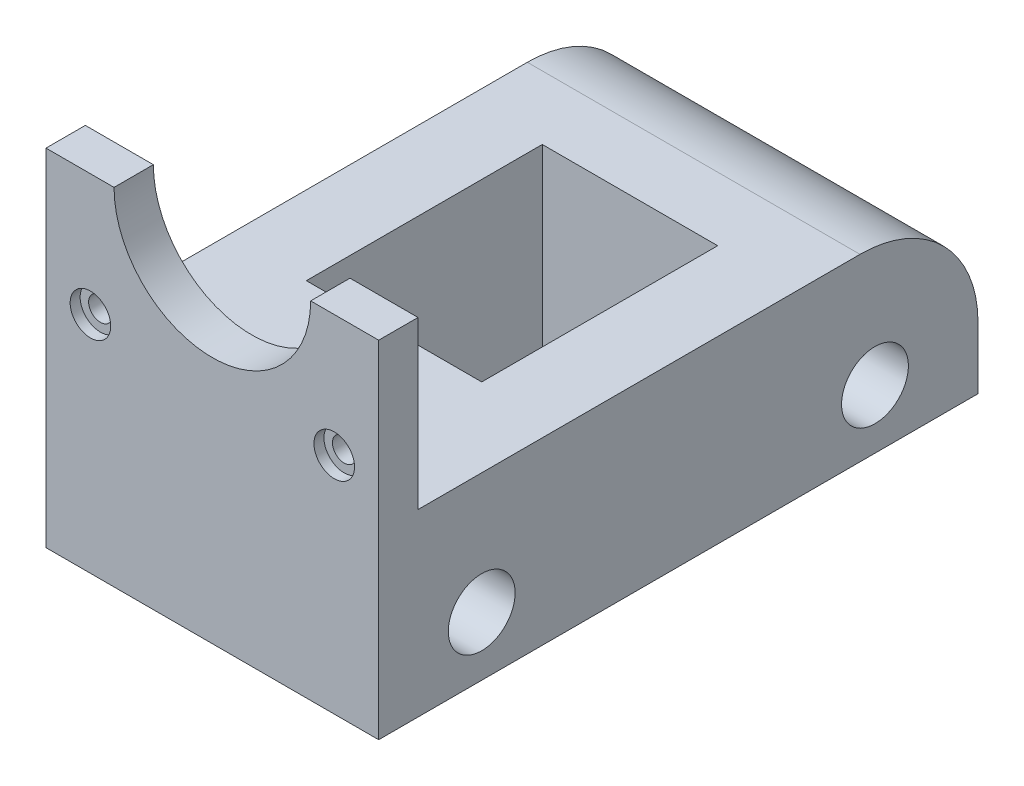
ISO-10303-21;
HEADER;
FILE_DESCRIPTION(('STEP AP214'),'2;1');
FILE_NAME('part.step','',(''),(''),'','','');
FILE_SCHEMA(('AUTOMOTIVE_DESIGN { 1 0 10303 214 1 1 1 1 }'));
ENDSEC;
DATA;
#1=APPLICATION_CONTEXT('core data for automotive mechanical design processes');
#2=APPLICATION_PROTOCOL_DEFINITION('international standard','automotive_design',2000,#1);
#3=PRODUCT_CONTEXT('',#1,'mechanical');
#4=PRODUCT('Part','Part','',(#3));
#5=PRODUCT_RELATED_PRODUCT_CATEGORY('part','',(#4));
#6=PRODUCT_DEFINITION_FORMATION('','',#4);
#7=PRODUCT_DEFINITION_CONTEXT('part definition',#1,'design');
#8=PRODUCT_DEFINITION('design','',#6,#7);
#9=PRODUCT_DEFINITION_SHAPE('','',#8);
#10=(LENGTH_UNIT() NAMED_UNIT(*) SI_UNIT(.MILLI.,.METRE.));
#11=(NAMED_UNIT(*) PLANE_ANGLE_UNIT() SI_UNIT($,.RADIAN.));
#12=(NAMED_UNIT(*) SI_UNIT($,.STERADIAN.) SOLID_ANGLE_UNIT());
#13=UNCERTAINTY_MEASURE_WITH_UNIT(LENGTH_MEASURE(1.E-05),#10,'distance_accuracy_value','');
#14=(GEOMETRIC_REPRESENTATION_CONTEXT(3) GLOBAL_UNCERTAINTY_ASSIGNED_CONTEXT((#13)) GLOBAL_UNIT_ASSIGNED_CONTEXT((#10,
#11,#12)) REPRESENTATION_CONTEXT('',''));
#15=CARTESIAN_POINT('',(0.,0.,0.));
#16=DIRECTION('',(0.,0.,1.));
#17=DIRECTION('',(1.,0.,0.));
#18=AXIS2_PLACEMENT_3D('',#15,#16,#17);
#19=CARTESIAN_POINT('',(-13.5314935064935,20.65,-10.162987012987));
#20=DIRECTION('',(0.,0.,1.));
#21=DIRECTION('',(1.,0.,0.));
#22=AXIS2_PLACEMENT_3D('',#19,#20,#21);
#23=CYLINDRICAL_SURFACE('',#22,1.5);
#24=CARTESIAN_POINT('',(-13.5314935064935,20.65,61.037012987013));
#25=DIRECTION('',(0.,0.,-1.));
#26=DIRECTION('',(-1.,0.,0.));
#27=AXIS2_PLACEMENT_3D('',#24,#25,#26);
#28=CIRCLE('',#27,1.5);
#29=CARTESIAN_POINT('',(-15.0314935064935,20.65,61.037012987013));
#30=VERTEX_POINT('',#29);
#31=EDGE_CURVE('E264',#30,#30,#28,.T.);
#32=ORIENTED_EDGE('',*,*,#31,.T.);
#33=EDGE_LOOP('',(#32));
#34=FACE_BOUND('',#33,.T.);
#35=CARTESIAN_POINT('',(-13.5314935064935,20.65,64.767012987013));
#36=DIRECTION('',(0.,0.,1.));
#37=DIRECTION('',(1.,0.,0.));
#38=AXIS2_PLACEMENT_3D('',#35,#36,#37);
#39=CIRCLE('',#38,1.5);
#40=CARTESIAN_POINT('',(-12.0314935064935,20.65,64.767012987013));
#41=VERTEX_POINT('',#40);
#42=EDGE_CURVE('E230',#41,#41,#39,.F.);
#43=ORIENTED_EDGE('',*,*,#42,.F.);
#44=EDGE_LOOP('',(#43));
#45=FACE_BOUND('',#44,.T.);
#46=ADVANCED_FACE('F60',(#34,#45),#23,.F.);
#47=CARTESIAN_POINT('',(-19.1814935064935,15.,66.037012987013));
#48=DIRECTION('',(0.,0.,-1.));
#49=DIRECTION('',(-1.,0.,0.));
#50=AXIS2_PLACEMENT_3D('',#47,#48,#49);
#51=PLANE('',#50);
#52=CARTESIAN_POINT('',(-13.5314935064935,20.65,66.037012987013));
#53=DIRECTION('',(0.,0.,1.));
#54=DIRECTION('',(1.,0.,0.));
#55=AXIS2_PLACEMENT_3D('',#52,#53,#54);
#56=CIRCLE('',#55,2.58);
#57=CARTESIAN_POINT('',(-10.9514935064935,20.65,66.037012987013));
#58=VERTEX_POINT('',#57);
#59=EDGE_CURVE('E231',#58,#58,#56,.T.);
#60=ORIENTED_EDGE('',*,*,#59,.F.);
#61=EDGE_LOOP('',(#60));
#62=FACE_BOUND('',#61,.T.);
#63=CARTESIAN_POINT('',(17.4685064935065,20.65,66.037012987013));
#64=DIRECTION('',(0.,0.,1.));
#65=DIRECTION('',(-1.,0.,0.));
#66=AXIS2_PLACEMENT_3D('',#63,#64,#65);
#67=CIRCLE('',#66,2.58);
#68=CARTESIAN_POINT('',(14.8885064935065,20.65,66.037012987013));
#69=VERTEX_POINT('',#68);
#70=EDGE_CURVE('E225',#69,#69,#67,.T.);
#71=ORIENTED_EDGE('',*,*,#70,.F.);
#72=EDGE_LOOP('',(#71));
#73=FACE_BOUND('',#72,.T.);
#74=CARTESIAN_POINT('',(1.9685064935065,36.15,66.037012987013));
#75=DIRECTION('',(0.,0.,1.));
#76=DIRECTION('',(1.,0.,0.));
#77=AXIS2_PLACEMENT_3D('',#74,#75,#76);
#78=CIRCLE('',#77,12.5);
#79=CARTESIAN_POINT('',(-10.5314935064935,36.15,66.037012987013));
#80=VERTEX_POINT('',#79);
#81=CARTESIAN_POINT('',(14.4685064935065,36.15,66.037012987013));
#82=VERTEX_POINT('',#81);
#83=EDGE_CURVE('E246',#80,#82,#78,.T.);
#84=ORIENTED_EDGE('',*,*,#83,.F.);
#85=DIRECTION('',(1.,0.,0.));
#86=VECTOR('',#85,1.);
#87=CARTESIAN_POINT('',(0.,36.15,66.037012987013));
#88=LINE('',#87,#86);
#89=CARTESIAN_POINT('',(-19.1814935064935,36.15,66.037012987013));
#90=VERTEX_POINT('',#89);
#91=EDGE_CURVE('E245',#90,#80,#88,.T.);
#92=ORIENTED_EDGE('',*,*,#91,.F.);
#93=DIRECTION('',(0.,-1.,0.));
#94=VECTOR('',#93,1.);
#95=CARTESIAN_POINT('',(-19.1814935064935,15.,66.037012987013));
#96=LINE('',#95,#94);
#97=CARTESIAN_POINT('',(-19.1814935064935,-7.85,66.037012987013));
#98=VERTEX_POINT('',#97);
#99=EDGE_CURVE('E292',#90,#98,#96,.T.);
#100=ORIENTED_EDGE('',*,*,#99,.T.);
#101=DIRECTION('',(-1.,0.,0.));
#102=VECTOR('',#101,1.);
#103=CARTESIAN_POINT('',(23.1185064935065,-7.85,66.037012987013));
#104=LINE('',#103,#102);
#105=CARTESIAN_POINT('',(23.1185064935065,-7.85,66.037012987013));
#106=VERTEX_POINT('',#105);
#107=EDGE_CURVE('E191',#106,#98,#104,.T.);
#108=ORIENTED_EDGE('',*,*,#107,.F.);
#109=DIRECTION('',(0.,-1.,0.));
#110=VECTOR('',#109,1.);
#111=CARTESIAN_POINT('',(23.1185064935065,15.,66.037012987013));
#112=LINE('',#111,#110);
#113=CARTESIAN_POINT('',(23.1185064935065,36.15,66.037012987013));
#114=VERTEX_POINT('',#113);
#115=EDGE_CURVE('E289',#114,#106,#112,.T.);
#116=ORIENTED_EDGE('',*,*,#115,.F.);
#117=EDGE_CURVE('E242',#82,#114,#88,.T.);
#118=ORIENTED_EDGE('',*,*,#117,.F.);
#119=EDGE_LOOP('',(#84,#92,#100,#108,#116,#118));
#120=FACE_BOUND('',#119,.T.);
#121=ADVANCED_FACE('F337',(#62,#73,#120),#51,.F.);
#122=CARTESIAN_POINT('',(0.,0.,61.037012987013));
#123=DIRECTION('',(0.,0.,-1.));
#124=DIRECTION('',(-1.,0.,0.));
#125=AXIS2_PLACEMENT_3D('',#122,#123,#124);
#126=PLANE('',#125);
#127=CARTESIAN_POINT('',(17.4685064935065,20.65,61.037012987013));
#128=DIRECTION('',(0.,0.,-1.));
#129=DIRECTION('',(-1.,0.,0.));
#130=AXIS2_PLACEMENT_3D('',#127,#128,#129);
#131=CIRCLE('',#130,1.5);
#132=CARTESIAN_POINT('',(15.9685064935065,20.65,61.037012987013));
#133=VERTEX_POINT('',#132);
#134=EDGE_CURVE('E306',#133,#133,#131,.F.);
#135=ORIENTED_EDGE('',*,*,#134,.T.);
#136=EDGE_LOOP('',(#135));
#137=FACE_BOUND('',#136,.T.);
#138=DIRECTION('',(-1.,0.,0.));
#139=VECTOR('',#138,1.);
#140=CARTESIAN_POINT('',(0.,36.15,61.037012987013));
#141=LINE('',#140,#139);
#142=CARTESIAN_POINT('',(-10.5314935064935,36.15,61.037012987013));
#143=VERTEX_POINT('',#142);
#144=CARTESIAN_POINT('',(-19.1814935064935,36.15,61.037012987013));
#145=VERTEX_POINT('',#144);
#146=EDGE_CURVE('E302',#143,#145,#141,.T.);
#147=ORIENTED_EDGE('',*,*,#146,.F.);
#148=CARTESIAN_POINT('',(1.9685064935065,36.15,61.037012987013));
#149=DIRECTION('',(0.,0.,-1.));
#150=DIRECTION('',(-1.,0.,0.));
#151=AXIS2_PLACEMENT_3D('',#148,#149,#150);
#152=CIRCLE('',#151,12.5);
#153=CARTESIAN_POINT('',(14.4685064935065,36.15,61.037012987013));
#154=VERTEX_POINT('',#153);
#155=EDGE_CURVE('E295',#154,#143,#152,.T.);
#156=ORIENTED_EDGE('',*,*,#155,.F.);
#157=DIRECTION('',(-1.,0.,0.));
#158=VECTOR('',#157,1.);
#159=CARTESIAN_POINT('',(0.,36.15,61.037012987013));
#160=LINE('',#159,#158);
#161=CARTESIAN_POINT('',(23.1185064935065,36.15,61.037012987013));
#162=VERTEX_POINT('',#161);
#163=EDGE_CURVE('E298',#162,#154,#160,.T.);
#164=ORIENTED_EDGE('',*,*,#163,.F.);
#165=DIRECTION('',(0.,1.,0.));
#166=VECTOR('',#165,1.);
#167=CARTESIAN_POINT('',(23.1185064935065,15.,61.037012987013));
#168=LINE('',#167,#166);
#169=CARTESIAN_POINT('',(23.1185064935065,15.,61.037012987013));
#170=VERTEX_POINT('',#169);
#171=EDGE_CURVE('E272',#170,#162,#168,.T.);
#172=ORIENTED_EDGE('',*,*,#171,.F.);
#173=DIRECTION('',(1.,0.,0.));
#174=VECTOR('',#173,1.);
#175=CARTESIAN_POINT('',(-19.1814935064935,15.,61.037012987013));
#176=LINE('',#175,#174);
#177=CARTESIAN_POINT('',(-19.1814935064935,15.,61.037012987013));
#178=VERTEX_POINT('',#177);
#179=EDGE_CURVE('E268',#178,#170,#176,.T.);
#180=ORIENTED_EDGE('',*,*,#179,.F.);
#181=DIRECTION('',(0.,-1.,0.));
#182=VECTOR('',#181,1.);
#183=CARTESIAN_POINT('',(-19.1814935064935,15.,61.037012987013));
#184=LINE('',#183,#182);
#185=EDGE_CURVE('E250',#145,#178,#184,.T.);
#186=ORIENTED_EDGE('',*,*,#185,.F.);
#187=EDGE_LOOP('',(#147,#156,#164,#172,#180,#186));
#188=FACE_BOUND('',#187,.T.);
#189=ORIENTED_EDGE('',*,*,#31,.F.);
#190=EDGE_LOOP('',(#189));
#191=FACE_BOUND('',#190,.T.);
#192=ADVANCED_FACE('F344',(#137,#188,#191),#126,.T.);
#193=CARTESIAN_POINT('',(0.,15.,0.));
#194=DIRECTION('',(0.,1.,0.));
#195=DIRECTION('',(0.,0.,1.));
#196=AXIS2_PLACEMENT_3D('',#193,#194,#195);
#197=PLANE('',#196);
#198=DIRECTION('',(0.,0.,-1.));
#199=VECTOR('',#198,1.);
#200=CARTESIAN_POINT('',(13.1185064935065,15.,0.));
#201=LINE('',#200,#199);
#202=CARTESIAN_POINT('',(13.1185064935065,15.,42.937012987013));
#203=VERTEX_POINT('',#202);
#204=CARTESIAN_POINT('',(13.1185064935065,15.,12.937012987013));
#205=VERTEX_POINT('',#204);
#206=EDGE_CURVE('E222',#203,#205,#201,.T.);
#207=ORIENTED_EDGE('',*,*,#206,.F.);
#208=DIRECTION('',(1.,0.,0.));
#209=VECTOR('',#208,1.);
#210=CARTESIAN_POINT('',(0.,15.,42.937012987013));
#211=LINE('',#210,#209);
#212=CARTESIAN_POINT('',(-9.18149350649351,15.,42.937012987013));
#213=VERTEX_POINT('',#212);
#214=EDGE_CURVE('E161',#213,#203,#211,.T.);
#215=ORIENTED_EDGE('',*,*,#214,.F.);
#216=DIRECTION('',(0.,0.,1.));
#217=VECTOR('',#216,1.);
#218=CARTESIAN_POINT('',(-9.18149350649351,15.,0.));
#219=LINE('',#218,#217);
#220=CARTESIAN_POINT('',(-9.18149350649351,15.,12.937012987013));
#221=VERTEX_POINT('',#220);
#222=EDGE_CURVE('E215',#221,#213,#219,.T.);
#223=ORIENTED_EDGE('',*,*,#222,.F.);
#224=DIRECTION('',(-1.,0.,0.));
#225=VECTOR('',#224,1.);
#226=CARTESIAN_POINT('',(0.,15.,12.937012987013));
#227=LINE('',#226,#225);
#228=EDGE_CURVE('E219',#205,#221,#227,.T.);
#229=ORIENTED_EDGE('',*,*,#228,.F.);
#230=EDGE_LOOP('',(#207,#215,#223,#229));
#231=FACE_BOUND('',#230,.T.);
#232=DIRECTION('',(0.,0.,-1.));
#233=VECTOR('',#232,1.);
#234=CARTESIAN_POINT('',(23.1185064935065,15.,-10.162987012987));
#235=LINE('',#234,#233);
#236=CARTESIAN_POINT('',(23.1185064935065,15.,4.83701298701298));
#237=VERTEX_POINT('',#236);
#238=EDGE_CURVE('E279',#170,#237,#235,.T.);
#239=ORIENTED_EDGE('',*,*,#238,.T.);
#240=DIRECTION('',(-1.,0.,0.));
#241=VECTOR('',#240,1.);
#242=CARTESIAN_POINT('',(-19.1814935064935,15.,4.83701298701298));
#243=LINE('',#242,#241);
#244=CARTESIAN_POINT('',(-19.1814935064935,15.,4.83701298701298));
#245=VERTEX_POINT('',#244);
#246=EDGE_CURVE('E305',#237,#245,#243,.T.);
#247=ORIENTED_EDGE('',*,*,#246,.T.);
#248=DIRECTION('',(0.,0.,1.));
#249=VECTOR('',#248,1.);
#250=CARTESIAN_POINT('',(-19.1814935064935,15.,-10.162987012987));
#251=LINE('',#250,#249);
#252=EDGE_CURVE('E276',#245,#178,#251,.T.);
#253=ORIENTED_EDGE('',*,*,#252,.T.);
#254=ORIENTED_EDGE('',*,*,#179,.T.);
#255=EDGE_LOOP('',(#239,#247,#253,#254));
#256=FACE_BOUND('',#255,.T.);
#257=ADVANCED_FACE('F451',(#231,#256),#197,.T.);
#258=CARTESIAN_POINT('',(-19.1814935064935,15.,-10.162987012987));
#259=DIRECTION('',(1.,0.,0.));
#260=DIRECTION('',(0.,0.,-1.));
#261=AXIS2_PLACEMENT_3D('',#258,#259,#260);
#262=PLANE('',#261);
#263=CARTESIAN_POINT('',(-19.1814935064935,-0.349999999999996,52.937012987013));
#264=DIRECTION('',(1.,0.,0.));
#265=DIRECTION('',(0.,0.,-1.));
#266=AXIS2_PLACEMENT_3D('',#263,#264,#265);
#267=CIRCLE('',#266,4.25000000000001);
#268=CARTESIAN_POINT('',(-19.1814935064935,-0.349999999999996,48.687012987013));
#269=VERTEX_POINT('',#268);
#270=EDGE_CURVE('E177',#269,#269,#267,.T.);
#271=ORIENTED_EDGE('',*,*,#270,.T.);
#272=EDGE_LOOP('',(#271));
#273=FACE_BOUND('',#272,.T.);
#274=CARTESIAN_POINT('',(-19.1814935064935,-0.349999999999996,2.93701298701299));
#275=DIRECTION('',(1.,0.,0.));
#276=DIRECTION('',(0.,0.,1.));
#277=AXIS2_PLACEMENT_3D('',#274,#275,#276);
#278=CIRCLE('',#277,4.25000000000001);
#279=CARTESIAN_POINT('',(-19.1814935064935,-0.349999999999996,7.187012987013));
#280=VERTEX_POINT('',#279);
#281=EDGE_CURVE('E431',#280,#280,#278,.T.);
#282=ORIENTED_EDGE('',*,*,#281,.T.);
#283=EDGE_LOOP('',(#282));
#284=FACE_BOUND('',#283,.T.);
#285=ORIENTED_EDGE('',*,*,#252,.F.);
#286=CARTESIAN_POINT('',(-19.1814935064935,0.,4.83701298701298));
#287=DIRECTION('',(1.,0.,0.));
#288=DIRECTION('',(0.,0.,-1.));
#289=AXIS2_PLACEMENT_3D('',#286,#287,#288);
#290=CIRCLE('',#289,15.);
#291=CARTESIAN_POINT('',(-19.1814935064935,0.,-10.162987012987));
#292=VERTEX_POINT('',#291);
#293=EDGE_CURVE('E83',#245,#292,#290,.F.);
#294=ORIENTED_EDGE('',*,*,#293,.T.);
#295=DIRECTION('',(0.,-1.,0.));
#296=VECTOR('',#295,1.);
#297=CARTESIAN_POINT('',(-19.1814935064935,15.,-10.162987012987));
#298=LINE('',#297,#296);
#299=CARTESIAN_POINT('',(-19.1814935064935,-7.85,-10.162987012987));
#300=VERTEX_POINT('',#299);
#301=EDGE_CURVE('E283',#292,#300,#298,.T.);
#302=ORIENTED_EDGE('',*,*,#301,.T.);
#303=DIRECTION('',(0.,0.,-1.));
#304=VECTOR('',#303,1.);
#305=CARTESIAN_POINT('',(-19.1814935064935,-7.85,66.037012987013));
#306=LINE('',#305,#304);
#307=EDGE_CURVE('E195',#98,#300,#306,.T.);
#308=ORIENTED_EDGE('',*,*,#307,.F.);
#309=ORIENTED_EDGE('',*,*,#99,.F.);
#310=DIRECTION('',(0.,0.,1.));
#311=VECTOR('',#310,1.);
#312=CARTESIAN_POINT('',(-19.1814935064935,36.15,-10.162987012987));
#313=LINE('',#312,#311);
#314=EDGE_CURVE('E251',#145,#90,#313,.T.);
#315=ORIENTED_EDGE('',*,*,#314,.F.);
#316=ORIENTED_EDGE('',*,*,#185,.T.);
#317=EDGE_LOOP('',(#285,#294,#302,#308,#309,#315,#316));
#318=FACE_BOUND('',#317,.T.);
#319=ADVANCED_FACE('F348',(#273,#284,#318),#262,.F.);
#320=CARTESIAN_POINT('',(23.1185064935065,15.,-10.162987012987));
#321=DIRECTION('',(-1.,0.,0.));
#322=DIRECTION('',(0.,0.,1.));
#323=AXIS2_PLACEMENT_3D('',#320,#321,#322);
#324=PLANE('',#323);
#325=CARTESIAN_POINT('',(23.1185064935065,-0.349999999999996,52.937012987013));
#326=DIRECTION('',(1.,0.,0.));
#327=DIRECTION('',(0.,0.,-1.));
#328=AXIS2_PLACEMENT_3D('',#325,#326,#327);
#329=CIRCLE('',#328,4.25000000000001);
#330=CARTESIAN_POINT('',(23.1185064935065,-0.349999999999996,48.687012987013));
#331=VERTEX_POINT('',#330);
#332=EDGE_CURVE('E428',#331,#331,#329,.T.);
#333=ORIENTED_EDGE('',*,*,#332,.F.);
#334=EDGE_LOOP('',(#333));
#335=FACE_BOUND('',#334,.T.);
#336=CARTESIAN_POINT('',(23.1185064935065,-0.349999999999996,2.93701298701299));
#337=DIRECTION('',(1.,0.,0.));
#338=DIRECTION('',(0.,0.,1.));
#339=AXIS2_PLACEMENT_3D('',#336,#337,#338);
#340=CIRCLE('',#339,4.25000000000001);
#341=CARTESIAN_POINT('',(23.1185064935065,-0.349999999999996,7.18701298701299));
#342=VERTEX_POINT('',#341);
#343=EDGE_CURVE('E437',#342,#342,#340,.T.);
#344=ORIENTED_EDGE('',*,*,#343,.F.);
#345=EDGE_LOOP('',(#344));
#346=FACE_BOUND('',#345,.T.);
#347=DIRECTION('',(0.,-1.,0.));
#348=VECTOR('',#347,1.);
#349=CARTESIAN_POINT('',(23.1185064935065,15.,-10.162987012987));
#350=LINE('',#349,#348);
#351=CARTESIAN_POINT('',(23.1185064935065,0.,-10.162987012987));
#352=VERTEX_POINT('',#351);
#353=CARTESIAN_POINT('',(23.1185064935065,-7.85,-10.162987012987));
#354=VERTEX_POINT('',#353);
#355=EDGE_CURVE('E286',#352,#354,#350,.T.);
#356=ORIENTED_EDGE('',*,*,#355,.F.);
#357=CARTESIAN_POINT('',(23.1185064935065,0.,4.83701298701298));
#358=DIRECTION('',(-1.,0.,0.));
#359=DIRECTION('',(0.,0.,1.));
#360=AXIS2_PLACEMENT_3D('',#357,#358,#359);
#361=CIRCLE('',#360,15.);
#362=EDGE_CURVE('E12',#352,#237,#361,.F.);
#363=ORIENTED_EDGE('',*,*,#362,.T.);
#364=ORIENTED_EDGE('',*,*,#238,.F.);
#365=ORIENTED_EDGE('',*,*,#171,.T.);
#366=DIRECTION('',(0.,0.,1.));
#367=VECTOR('',#366,1.);
#368=CARTESIAN_POINT('',(23.1185064935065,36.15,-10.162987012987));
#369=LINE('',#368,#367);
#370=EDGE_CURVE('E254',#162,#114,#369,.T.);
#371=ORIENTED_EDGE('',*,*,#370,.T.);
#372=ORIENTED_EDGE('',*,*,#115,.T.);
#373=DIRECTION('',(0.,0.,1.));
#374=VECTOR('',#373,1.);
#375=CARTESIAN_POINT('',(23.1185064935065,-7.85,-10.162987012987));
#376=LINE('',#375,#374);
#377=EDGE_CURVE('E166',#354,#106,#376,.T.);
#378=ORIENTED_EDGE('',*,*,#377,.F.);
#379=EDGE_LOOP('',(#356,#363,#364,#365,#371,#372,#378));
#380=FACE_BOUND('',#379,.T.);
#381=ADVANCED_FACE('F355',(#335,#346,#380),#324,.F.);
#382=CARTESIAN_POINT('',(-19.1814935064935,15.,-10.162987012987));
#383=DIRECTION('',(0.,0.,1.));
#384=DIRECTION('',(1.,0.,0.));
#385=AXIS2_PLACEMENT_3D('',#382,#383,#384);
#386=PLANE('',#385);
#387=ORIENTED_EDGE('',*,*,#301,.F.);
#388=DIRECTION('',(-1.,0.,0.));
#389=VECTOR('',#388,1.);
#390=CARTESIAN_POINT('',(23.1185064935065,0.,-10.162987012987));
#391=LINE('',#390,#389);
#392=EDGE_CURVE('E69',#292,#352,#391,.F.);
#393=ORIENTED_EDGE('',*,*,#392,.T.);
#394=ORIENTED_EDGE('',*,*,#355,.T.);
#395=DIRECTION('',(1.,0.,0.));
#396=VECTOR('',#395,1.);
#397=CARTESIAN_POINT('',(-19.1814935064935,-7.85,-10.162987012987));
#398=LINE('',#397,#396);
#399=EDGE_CURVE('E199',#300,#354,#398,.T.);
#400=ORIENTED_EDGE('',*,*,#399,.F.);
#401=EDGE_LOOP('',(#387,#393,#394,#400));
#402=FACE_BOUND('',#401,.T.);
#403=ADVANCED_FACE('F368',(#402),#386,.F.);
#404=CARTESIAN_POINT('',(0.,36.15,-10.162987012987));
#405=DIRECTION('',(0.,-1.,0.));
#406=DIRECTION('',(0.,0.,-1.));
#407=AXIS2_PLACEMENT_3D('',#404,#405,#406);
#408=PLANE('',#407);
#409=ORIENTED_EDGE('',*,*,#146,.T.);
#410=ORIENTED_EDGE('',*,*,#314,.T.);
#411=ORIENTED_EDGE('',*,*,#91,.T.);
#412=DIRECTION('',(0.,0.,1.));
#413=VECTOR('',#412,1.);
#414=CARTESIAN_POINT('',(-10.5314935064935,36.15,-10.162987012987));
#415=LINE('',#414,#413);
#416=EDGE_CURVE('E247',#143,#80,#415,.T.);
#417=ORIENTED_EDGE('',*,*,#416,.F.);
#418=EDGE_LOOP('',(#409,#410,#411,#417));
#419=FACE_BOUND('',#418,.T.);
#420=ADVANCED_FACE('F331',(#419),#408,.F.);
#421=ORIENTED_EDGE('',*,*,#163,.T.);
#422=DIRECTION('',(0.,0.,1.));
#423=VECTOR('',#422,1.);
#424=CARTESIAN_POINT('',(14.4685064935065,36.15,-10.162987012987));
#425=LINE('',#424,#423);
#426=EDGE_CURVE('E258',#154,#82,#425,.T.);
#427=ORIENTED_EDGE('',*,*,#426,.T.);
#428=ORIENTED_EDGE('',*,*,#117,.T.);
#429=ORIENTED_EDGE('',*,*,#370,.F.);
#430=EDGE_LOOP('',(#421,#427,#428,#429));
#431=FACE_BOUND('',#430,.T.);
#432=ADVANCED_FACE('F359',(#431),#408,.F.);
#433=CARTESIAN_POINT('',(1.9685064935065,36.15,-10.162987012987));
#434=DIRECTION('',(0.,0.,1.));
#435=DIRECTION('',(1.,0.,0.));
#436=AXIS2_PLACEMENT_3D('',#433,#434,#435);
#437=CYLINDRICAL_SURFACE('',#436,12.5);
#438=ORIENTED_EDGE('',*,*,#155,.T.);
#439=ORIENTED_EDGE('',*,*,#416,.T.);
#440=ORIENTED_EDGE('',*,*,#83,.T.);
#441=ORIENTED_EDGE('',*,*,#426,.F.);
#442=EDGE_LOOP('',(#438,#439,#440,#441));
#443=FACE_BOUND('',#442,.T.);
#444=ADVANCED_FACE('F340',(#443),#437,.F.);
#445=CARTESIAN_POINT('',(17.4685064935065,20.65,-10.162987012987));
#446=DIRECTION('',(0.,0.,1.));
#447=DIRECTION('',(1.,0.,0.));
#448=AXIS2_PLACEMENT_3D('',#445,#446,#447);
#449=CYLINDRICAL_SURFACE('',#448,1.5);
#450=CARTESIAN_POINT('',(17.4685064935065,20.65,64.767012987013));
#451=DIRECTION('',(0.,0.,-1.));
#452=DIRECTION('',(-1.,0.,0.));
#453=AXIS2_PLACEMENT_3D('',#450,#451,#452);
#454=CIRCLE('',#453,1.5);
#455=CARTESIAN_POINT('',(15.9685064935065,20.65,64.767012987013));
#456=VERTEX_POINT('',#455);
#457=EDGE_CURVE('E310',#456,#456,#454,.T.);
#458=ORIENTED_EDGE('',*,*,#457,.F.);
#459=EDGE_LOOP('',(#458));
#460=FACE_BOUND('',#459,.T.);
#461=ORIENTED_EDGE('',*,*,#134,.F.);
#462=EDGE_LOOP('',(#461));
#463=FACE_BOUND('',#462,.T.);
#464=ADVANCED_FACE('F362',(#460,#463),#449,.F.);
#465=CARTESIAN_POINT('',(-13.5314935064935,20.65,64.767012987013));
#466=DIRECTION('',(0.,0.,1.));
#467=DIRECTION('',(1.,0.,0.));
#468=AXIS2_PLACEMENT_3D('',#465,#466,#467);
#469=PLANE('',#468);
#470=CARTESIAN_POINT('',(-13.5314935064935,20.65,64.767012987013));
#471=DIRECTION('',(0.,0.,1.));
#472=DIRECTION('',(1.,0.,0.));
#473=AXIS2_PLACEMENT_3D('',#470,#471,#472);
#474=CIRCLE('',#473,2.58);
#475=CARTESIAN_POINT('',(-10.9514935064935,20.65,64.767012987013));
#476=VERTEX_POINT('',#475);
#477=EDGE_CURVE('E226',#476,#476,#474,.T.);
#478=ORIENTED_EDGE('',*,*,#477,.T.);
#479=EDGE_LOOP('',(#478));
#480=FACE_BOUND('',#479,.T.);
#481=ORIENTED_EDGE('',*,*,#42,.T.);
#482=EDGE_LOOP('',(#481));
#483=FACE_BOUND('',#482,.T.);
#484=ADVANCED_FACE('F371',(#480,#483),#469,.T.);
#485=CARTESIAN_POINT('',(-13.5314935064935,20.65,64.767012987013));
#486=DIRECTION('',(0.,0.,1.));
#487=DIRECTION('',(1.,0.,0.));
#488=AXIS2_PLACEMENT_3D('',#485,#486,#487);
#489=CYLINDRICAL_SURFACE('',#488,2.58);
#490=ORIENTED_EDGE('',*,*,#477,.F.);
#491=EDGE_LOOP('',(#490));
#492=FACE_BOUND('',#491,.T.);
#493=ORIENTED_EDGE('',*,*,#59,.T.);
#494=EDGE_LOOP('',(#493));
#495=FACE_BOUND('',#494,.T.);
#496=ADVANCED_FACE('F387',(#492,#495),#489,.F.);
#497=CARTESIAN_POINT('',(17.4685064935065,20.65,64.767012987013));
#498=DIRECTION('',(0.,0.,1.));
#499=DIRECTION('',(1.,0.,0.));
#500=AXIS2_PLACEMENT_3D('',#497,#498,#499);
#501=CYLINDRICAL_SURFACE('',#500,2.58);
#502=CARTESIAN_POINT('',(17.4685064935065,20.65,64.767012987013));
#503=DIRECTION('',(0.,0.,1.));
#504=DIRECTION('',(-1.,0.,0.));
#505=AXIS2_PLACEMENT_3D('',#502,#503,#504);
#506=CIRCLE('',#505,2.58);
#507=CARTESIAN_POINT('',(14.8885064935065,20.65,64.767012987013));
#508=VERTEX_POINT('',#507);
#509=EDGE_CURVE('E235',#508,#508,#506,.T.);
#510=ORIENTED_EDGE('',*,*,#509,.F.);
#511=EDGE_LOOP('',(#510));
#512=FACE_BOUND('',#511,.T.);
#513=ORIENTED_EDGE('',*,*,#70,.T.);
#514=EDGE_LOOP('',(#513));
#515=FACE_BOUND('',#514,.T.);
#516=ADVANCED_FACE('F383',(#512,#515),#501,.F.);
#517=CARTESIAN_POINT('',(17.4685064935065,20.65,64.767012987013));
#518=DIRECTION('',(0.,0.,-1.));
#519=DIRECTION('',(-1.,0.,0.));
#520=AXIS2_PLACEMENT_3D('',#517,#518,#519);
#521=PLANE('',#520);
#522=ORIENTED_EDGE('',*,*,#457,.T.);
#523=EDGE_LOOP('',(#522));
#524=FACE_BOUND('',#523,.T.);
#525=ORIENTED_EDGE('',*,*,#509,.T.);
#526=EDGE_LOOP('',(#525));
#527=FACE_BOUND('',#526,.T.);
#528=ADVANCED_FACE('F386',(#524,#527),#521,.F.);
#529=CARTESIAN_POINT('',(13.1185064935065,36.15,12.937012987013));
#530=DIRECTION('',(1.,0.,0.));
#531=DIRECTION('',(0.,0.,-1.));
#532=AXIS2_PLACEMENT_3D('',#529,#530,#531);
#533=PLANE('',#532);
#534=ORIENTED_EDGE('',*,*,#206,.T.);
#535=DIRECTION('',(0.,-1.,0.));
#536=VECTOR('',#535,1.);
#537=CARTESIAN_POINT('',(13.1185064935065,36.15,12.937012987013));
#538=LINE('',#537,#536);
#539=CARTESIAN_POINT('',(13.1185064935065,-7.85,12.937012987013));
#540=VERTEX_POINT('',#539);
#541=EDGE_CURVE('E172',#205,#540,#538,.T.);
#542=ORIENTED_EDGE('',*,*,#541,.T.);
#543=DIRECTION('',(0.,0.,1.));
#544=VECTOR('',#543,1.);
#545=CARTESIAN_POINT('',(13.1185064935065,-7.85,12.937012987013));
#546=LINE('',#545,#544);
#547=CARTESIAN_POINT('',(13.1185064935065,-7.85,42.937012987013));
#548=VERTEX_POINT('',#547);
#549=EDGE_CURVE('E169',#540,#548,#546,.T.);
#550=ORIENTED_EDGE('',*,*,#549,.T.);
#551=DIRECTION('',(0.,-1.,0.));
#552=VECTOR('',#551,1.);
#553=CARTESIAN_POINT('',(13.1185064935065,36.15,42.937012987013));
#554=LINE('',#553,#552);
#555=EDGE_CURVE('E154',#203,#548,#554,.T.);
#556=ORIENTED_EDGE('',*,*,#555,.F.);
#557=EDGE_LOOP('',(#534,#542,#550,#556));
#558=FACE_BOUND('',#557,.T.);
#559=ADVANCED_FACE('F170',(#558),#533,.F.);
#560=CARTESIAN_POINT('',(-9.18149350649351,36.15,12.937012987013));
#561=DIRECTION('',(0.,0.,-1.));
#562=DIRECTION('',(-1.,0.,0.));
#563=AXIS2_PLACEMENT_3D('',#560,#561,#562);
#564=PLANE('',#563);
#565=ORIENTED_EDGE('',*,*,#228,.T.);
#566=DIRECTION('',(0.,-1.,0.));
#567=VECTOR('',#566,1.);
#568=CARTESIAN_POINT('',(-9.18149350649351,36.15,12.937012987013));
#569=LINE('',#568,#567);
#570=CARTESIAN_POINT('',(-9.18149350649351,-7.85,12.937012987013));
#571=VERTEX_POINT('',#570);
#572=EDGE_CURVE('E208',#221,#571,#569,.T.);
#573=ORIENTED_EDGE('',*,*,#572,.T.);
#574=DIRECTION('',(1.,0.,0.));
#575=VECTOR('',#574,1.);
#576=CARTESIAN_POINT('',(-9.18149350649351,-7.85,12.937012987013));
#577=LINE('',#576,#575);
#578=EDGE_CURVE('E185',#571,#540,#577,.T.);
#579=ORIENTED_EDGE('',*,*,#578,.T.);
#580=ORIENTED_EDGE('',*,*,#541,.F.);
#581=EDGE_LOOP('',(#565,#573,#579,#580));
#582=FACE_BOUND('',#581,.T.);
#583=ADVANCED_FACE('F400',(#582),#564,.F.);
#584=CARTESIAN_POINT('',(-9.18149350649351,36.15,12.937012987013));
#585=DIRECTION('',(-1.,0.,0.));
#586=DIRECTION('',(0.,0.,1.));
#587=AXIS2_PLACEMENT_3D('',#584,#585,#586);
#588=PLANE('',#587);
#589=ORIENTED_EDGE('',*,*,#222,.T.);
#590=DIRECTION('',(0.,-1.,0.));
#591=VECTOR('',#590,1.);
#592=CARTESIAN_POINT('',(-9.18149350649351,36.15,42.937012987013));
#593=LINE('',#592,#591);
#594=CARTESIAN_POINT('',(-9.18149350649351,-7.85,42.937012987013));
#595=VERTEX_POINT('',#594);
#596=EDGE_CURVE('E165',#213,#595,#593,.T.);
#597=ORIENTED_EDGE('',*,*,#596,.T.);
#598=DIRECTION('',(0.,0.,-1.));
#599=VECTOR('',#598,1.);
#600=CARTESIAN_POINT('',(-9.18149350649351,-7.85,42.937012987013));
#601=LINE('',#600,#599);
#602=EDGE_CURVE('E181',#595,#571,#601,.T.);
#603=ORIENTED_EDGE('',*,*,#602,.T.);
#604=ORIENTED_EDGE('',*,*,#572,.F.);
#605=EDGE_LOOP('',(#589,#597,#603,#604));
#606=FACE_BOUND('',#605,.T.);
#607=ADVANCED_FACE('F403',(#606),#588,.F.);
#608=CARTESIAN_POINT('',(-9.18149350649351,36.15,42.937012987013));
#609=DIRECTION('',(0.,0.,1.));
#610=DIRECTION('',(1.,0.,0.));
#611=AXIS2_PLACEMENT_3D('',#608,#609,#610);
#612=PLANE('',#611);
#613=ORIENTED_EDGE('',*,*,#214,.T.);
#614=ORIENTED_EDGE('',*,*,#555,.T.);
#615=DIRECTION('',(-1.,0.,0.));
#616=VECTOR('',#615,1.);
#617=CARTESIAN_POINT('',(13.1185064935065,-7.85,42.937012987013));
#618=LINE('',#617,#616);
#619=EDGE_CURVE('E158',#548,#595,#618,.T.);
#620=ORIENTED_EDGE('',*,*,#619,.T.);
#621=ORIENTED_EDGE('',*,*,#596,.F.);
#622=EDGE_LOOP('',(#613,#614,#620,#621));
#623=FACE_BOUND('',#622,.T.);
#624=ADVANCED_FACE('F156',(#623),#612,.F.);
#625=CARTESIAN_POINT('',(0.,-7.85,0.));
#626=DIRECTION('',(0.,-1.,0.));
#627=DIRECTION('',(0.,0.,-1.));
#628=AXIS2_PLACEMENT_3D('',#625,#626,#627);
#629=PLANE('',#628);
#630=ORIENTED_EDGE('',*,*,#107,.T.);
#631=ORIENTED_EDGE('',*,*,#307,.T.);
#632=ORIENTED_EDGE('',*,*,#399,.T.);
#633=ORIENTED_EDGE('',*,*,#377,.T.);
#634=EDGE_LOOP('',(#630,#631,#632,#633));
#635=FACE_BOUND('',#634,.T.);
#636=ORIENTED_EDGE('',*,*,#619,.F.);
#637=ORIENTED_EDGE('',*,*,#549,.F.);
#638=ORIENTED_EDGE('',*,*,#578,.F.);
#639=ORIENTED_EDGE('',*,*,#602,.F.);
#640=EDGE_LOOP('',(#636,#637,#638,#639));
#641=FACE_BOUND('',#640,.T.);
#642=ADVANCED_FACE('F179',(#635,#641),#629,.T.);
#643=CARTESIAN_POINT('',(-19.1814935064935,-0.349999999999996,2.93701298701299));
#644=DIRECTION('',(1.,0.,0.));
#645=DIRECTION('',(0.,0.,-1.));
#646=AXIS2_PLACEMENT_3D('',#643,#644,#645);
#647=CYLINDRICAL_SURFACE('',#646,4.25000000000001);
#648=ORIENTED_EDGE('',*,*,#281,.F.);
#649=EDGE_LOOP('',(#648));
#650=FACE_BOUND('',#649,.T.);
#651=ORIENTED_EDGE('',*,*,#343,.T.);
#652=EDGE_LOOP('',(#651));
#653=FACE_BOUND('',#652,.T.);
#654=ADVANCED_FACE('F412',(#650,#653),#647,.F.);
#655=CARTESIAN_POINT('',(-19.1814935064935,-0.349999999999996,52.937012987013));
#656=DIRECTION('',(1.,0.,0.));
#657=DIRECTION('',(0.,0.,-1.));
#658=AXIS2_PLACEMENT_3D('',#655,#656,#657);
#659=CYLINDRICAL_SURFACE('',#658,4.25000000000001);
#660=ORIENTED_EDGE('',*,*,#270,.F.);
#661=EDGE_LOOP('',(#660));
#662=FACE_BOUND('',#661,.T.);
#663=ORIENTED_EDGE('',*,*,#332,.T.);
#664=EDGE_LOOP('',(#663));
#665=FACE_BOUND('',#664,.T.);
#666=ADVANCED_FACE('F415',(#662,#665),#659,.F.);
#667=CARTESIAN_POINT('',(0.,0.,4.83701298701298));
#668=DIRECTION('',(1.,0.,0.));
#669=DIRECTION('',(0.,0.,-1.));
#670=AXIS2_PLACEMENT_3D('',#667,#668,#669);
#671=CYLINDRICAL_SURFACE('',#670,15.);
#672=ORIENTED_EDGE('',*,*,#362,.F.);
#673=ORIENTED_EDGE('',*,*,#392,.F.);
#674=ORIENTED_EDGE('',*,*,#293,.F.);
#675=ORIENTED_EDGE('',*,*,#246,.F.);
#676=EDGE_LOOP('',(#672,#673,#674,#675));
#677=FACE_BOUND('',#676,.T.);
#678=ADVANCED_FACE('F62',(#677),#671,.T.);
#679=CLOSED_SHELL('',(#46,#121,#192,#257,#319,#381,#403,#420,#432,#444,#464,#484,#496,#516,#528,
#559,#583,#607,#624,#642,#654,#666,#678));
#680=MANIFOLD_SOLID_BREP('B2',#679);
#681=ADVANCED_BREP_SHAPE_REPRESENTATION('',(#18,#680),#14);
#682=SHAPE_DEFINITION_REPRESENTATION(#9,#681);
ENDSEC;
END-ISO-10303-21;
